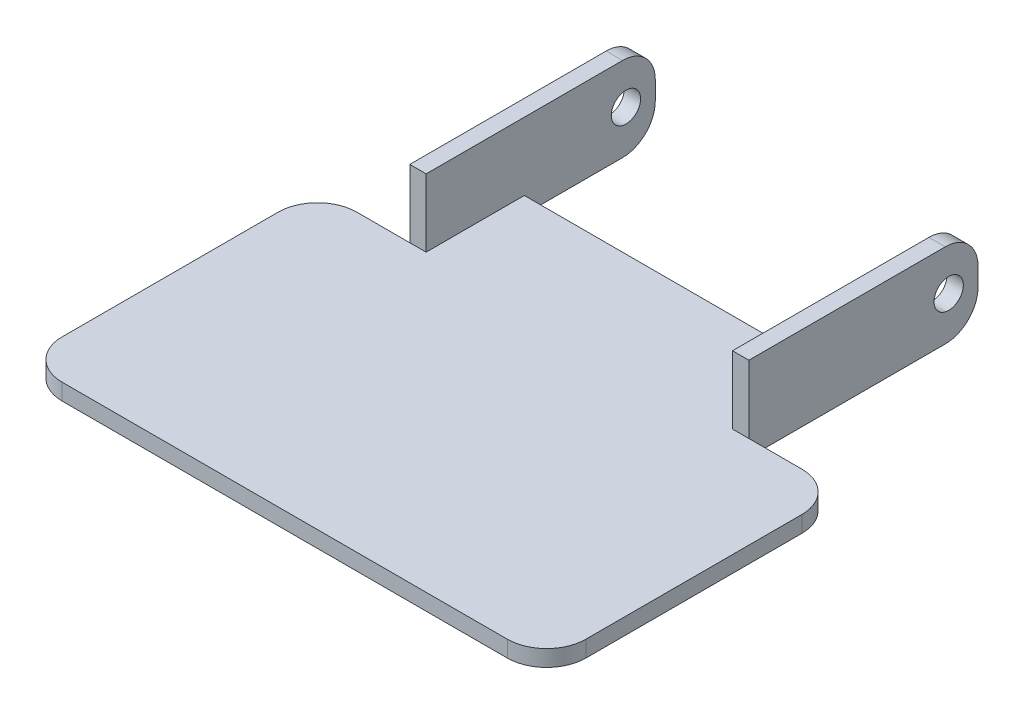
ISO-10303-21;
HEADER;
FILE_DESCRIPTION(('STEP AP214'),'2;1');
FILE_NAME('part.step','',(''),(''),'','','');
FILE_SCHEMA(('AUTOMOTIVE_DESIGN { 1 0 10303 214 1 1 1 1 }'));
ENDSEC;
DATA;
#1=APPLICATION_CONTEXT('core data for automotive mechanical design processes');
#2=APPLICATION_PROTOCOL_DEFINITION('international standard','automotive_design',2000,#1);
#3=PRODUCT_CONTEXT('',#1,'mechanical');
#4=PRODUCT('Part','Part','',(#3));
#5=PRODUCT_RELATED_PRODUCT_CATEGORY('part','',(#4));
#6=PRODUCT_DEFINITION_FORMATION('','',#4);
#7=PRODUCT_DEFINITION_CONTEXT('part definition',#1,'design');
#8=PRODUCT_DEFINITION('design','',#6,#7);
#9=PRODUCT_DEFINITION_SHAPE('','',#8);
#10=(LENGTH_UNIT() NAMED_UNIT(*) SI_UNIT(.MILLI.,.METRE.));
#11=(NAMED_UNIT(*) PLANE_ANGLE_UNIT() SI_UNIT($,.RADIAN.));
#12=(NAMED_UNIT(*) SI_UNIT($,.STERADIAN.) SOLID_ANGLE_UNIT());
#13=UNCERTAINTY_MEASURE_WITH_UNIT(LENGTH_MEASURE(1.E-05),#10,'distance_accuracy_value','');
#14=(GEOMETRIC_REPRESENTATION_CONTEXT(3) GLOBAL_UNCERTAINTY_ASSIGNED_CONTEXT((#13)) GLOBAL_UNIT_ASSIGNED_CONTEXT((#10,
#11,#12)) REPRESENTATION_CONTEXT('',''));
#15=CARTESIAN_POINT('',(0.,0.,0.));
#16=DIRECTION('',(0.,0.,1.));
#17=DIRECTION('',(1.,0.,0.));
#18=AXIS2_PLACEMENT_3D('',#15,#16,#17);
#19=CARTESIAN_POINT('',(0.,1.5875,-28.575));
#20=DIRECTION('',(0.,-1.,0.));
#21=DIRECTION('',(0.,0.,-1.));
#22=AXIS2_PLACEMENT_3D('',#19,#20,#21);
#23=PLANE('',#22);
#24=DIRECTION('',(-1.,0.,0.));
#25=VECTOR('',#24,1.);
#26=CARTESIAN_POINT('',(0.,1.5875,-28.575));
#27=LINE('',#26,#25);
#28=CARTESIAN_POINT('',(8.9535,1.5875,-28.575));
#29=VERTEX_POINT('',#28);
#30=CARTESIAN_POINT('',(3.81,1.5875,-28.575));
#31=VERTEX_POINT('',#30);
#32=EDGE_CURVE('E254',#29,#31,#27,.T.);
#33=ORIENTED_EDGE('',*,*,#32,.T.);
#34=CARTESIAN_POINT('',(3.81,1.5875,-24.765));
#35=DIRECTION('',(0.,-1.,0.));
#36=DIRECTION('',(0.,0.,-1.));
#37=AXIS2_PLACEMENT_3D('',#34,#35,#36);
#38=CIRCLE('',#37,3.81);
#39=CARTESIAN_POINT('',(0.,1.5875,-24.765));
#40=VERTEX_POINT('',#39);
#41=EDGE_CURVE('E319',#31,#40,#38,.F.);
#42=ORIENTED_EDGE('',*,*,#41,.T.);
#43=DIRECTION('',(0.,0.,1.));
#44=VECTOR('',#43,1.);
#45=CARTESIAN_POINT('',(0.,1.5875,0.));
#46=LINE('',#45,#44);
#47=CARTESIAN_POINT('',(0.,1.5875,-3.81));
#48=VERTEX_POINT('',#47);
#49=EDGE_CURVE('E245',#40,#48,#46,.T.);
#50=ORIENTED_EDGE('',*,*,#49,.T.);
#51=CARTESIAN_POINT('',(3.81,1.5875,-3.81));
#52=DIRECTION('',(0.,-1.,0.));
#53=DIRECTION('',(0.,0.,-1.));
#54=AXIS2_PLACEMENT_3D('',#51,#52,#53);
#55=CIRCLE('',#54,3.81);
#56=CARTESIAN_POINT('',(3.81,1.5875,0.));
#57=VERTEX_POINT('',#56);
#58=EDGE_CURVE('E317',#48,#57,#55,.F.);
#59=ORIENTED_EDGE('',*,*,#58,.T.);
#60=DIRECTION('',(1.,0.,0.));
#61=VECTOR('',#60,1.);
#62=CARTESIAN_POINT('',(0.,1.5875,0.));
#63=LINE('',#62,#61);
#64=CARTESIAN_POINT('',(46.99,1.5875,0.));
#65=VERTEX_POINT('',#64);
#66=EDGE_CURVE('E489',#57,#65,#63,.T.);
#67=ORIENTED_EDGE('',*,*,#66,.T.);
#68=CARTESIAN_POINT('',(46.99,1.5875,-3.81));
#69=DIRECTION('',(0.,-1.,0.));
#70=DIRECTION('',(0.,0.,-1.));
#71=AXIS2_PLACEMENT_3D('',#68,#69,#70);
#72=CIRCLE('',#71,3.81);
#73=CARTESIAN_POINT('',(50.8,1.5875,-3.81));
#74=VERTEX_POINT('',#73);
#75=EDGE_CURVE('E315',#65,#74,#72,.F.);
#76=ORIENTED_EDGE('',*,*,#75,.T.);
#77=DIRECTION('',(0.,0.,-1.));
#78=VECTOR('',#77,1.);
#79=CARTESIAN_POINT('',(50.8,1.5875,0.));
#80=LINE('',#79,#78);
#81=CARTESIAN_POINT('',(50.8,1.5875,-24.765));
#82=VERTEX_POINT('',#81);
#83=EDGE_CURVE('E331',#74,#82,#80,.T.);
#84=ORIENTED_EDGE('',*,*,#83,.T.);
#85=CARTESIAN_POINT('',(46.99,1.5875,-24.765));
#86=DIRECTION('',(0.,-1.,0.));
#87=DIRECTION('',(0.,0.,-1.));
#88=AXIS2_PLACEMENT_3D('',#85,#86,#87);
#89=CIRCLE('',#88,3.81);
#90=CARTESIAN_POINT('',(46.99,1.5875,-28.575));
#91=VERTEX_POINT('',#90);
#92=EDGE_CURVE('E48',#82,#91,#89,.F.);
#93=ORIENTED_EDGE('',*,*,#92,.T.);
#94=DIRECTION('',(-1.,0.,0.));
#95=VECTOR('',#94,1.);
#96=CARTESIAN_POINT('',(41.8465,1.5875,-28.575));
#97=LINE('',#96,#95);
#98=CARTESIAN_POINT('',(41.8465,1.5875,-28.575));
#99=VERTEX_POINT('',#98);
#100=EDGE_CURVE('E255',#91,#99,#97,.T.);
#101=ORIENTED_EDGE('',*,*,#100,.T.);
#102=DIRECTION('',(1.,0.,0.));
#103=VECTOR('',#102,1.);
#104=CARTESIAN_POINT('',(41.8465,1.5875,-28.575));
#105=LINE('',#104,#103);
#106=CARTESIAN_POINT('',(40.259,1.5875,-28.575));
#107=VERTEX_POINT('',#106);
#108=EDGE_CURVE('E222',#107,#99,#105,.T.);
#109=ORIENTED_EDGE('',*,*,#108,.F.);
#110=DIRECTION('',(0.,0.,1.));
#111=VECTOR('',#110,1.);
#112=CARTESIAN_POINT('',(40.259,1.5875,-28.575));
#113=LINE('',#112,#111);
#114=CARTESIAN_POINT('',(40.259,1.5875,-38.1));
#115=VERTEX_POINT('',#114);
#116=EDGE_CURVE('E208',#115,#107,#113,.T.);
#117=ORIENTED_EDGE('',*,*,#116,.F.);
#118=DIRECTION('',(-1.,0.,0.));
#119=VECTOR('',#118,1.);
#120=CARTESIAN_POINT('',(10.541,1.5875,-38.1));
#121=LINE('',#120,#119);
#122=CARTESIAN_POINT('',(10.541,1.5875,-38.1));
#123=VERTEX_POINT('',#122);
#124=EDGE_CURVE('E252',#115,#123,#121,.T.);
#125=ORIENTED_EDGE('',*,*,#124,.T.);
#126=DIRECTION('',(0.,0.,-1.));
#127=VECTOR('',#126,1.);
#128=CARTESIAN_POINT('',(10.541,1.5875,-28.575));
#129=LINE('',#128,#127);
#130=CARTESIAN_POINT('',(10.541,1.5875,-28.575));
#131=VERTEX_POINT('',#130);
#132=EDGE_CURVE('E228',#131,#123,#129,.T.);
#133=ORIENTED_EDGE('',*,*,#132,.F.);
#134=DIRECTION('',(1.,0.,0.));
#135=VECTOR('',#134,1.);
#136=CARTESIAN_POINT('',(8.9535,1.5875,-28.575));
#137=LINE('',#136,#135);
#138=EDGE_CURVE('E211',#29,#131,#137,.T.);
#139=ORIENTED_EDGE('',*,*,#138,.F.);
#140=EDGE_LOOP('',(#33,#42,#50,#59,#67,#76,#84,#93,#101,#109,#117,#125,#133,#139));
#141=FACE_BOUND('',#140,.T.);
#142=ADVANCED_FACE('F33',(#141),#23,.F.);
#143=CARTESIAN_POINT('',(0.,1.5875,0.));
#144=DIRECTION('',(1.,0.,0.));
#145=DIRECTION('',(0.,0.,-1.));
#146=AXIS2_PLACEMENT_3D('',#143,#144,#145);
#147=PLANE('',#146);
#148=ORIENTED_EDGE('',*,*,#49,.F.);
#149=DIRECTION('',(0.,-1.,0.));
#150=VECTOR('',#149,1.);
#151=CARTESIAN_POINT('',(0.,1.5875,-24.765));
#152=LINE('',#151,#150);
#153=CARTESIAN_POINT('',(0.,0.,-24.765));
#154=VERTEX_POINT('',#153);
#155=EDGE_CURVE('E301',#40,#154,#152,.T.);
#156=ORIENTED_EDGE('',*,*,#155,.T.);
#157=DIRECTION('',(0.,0.,1.));
#158=VECTOR('',#157,1.);
#159=CARTESIAN_POINT('',(0.,0.,0.));
#160=LINE('',#159,#158);
#161=CARTESIAN_POINT('',(0.,0.,-3.81));
#162=VERTEX_POINT('',#161);
#163=EDGE_CURVE('E241',#154,#162,#160,.T.);
#164=ORIENTED_EDGE('',*,*,#163,.T.);
#165=DIRECTION('',(0.,-1.,0.));
#166=VECTOR('',#165,1.);
#167=CARTESIAN_POINT('',(0.,1.5875,-3.81));
#168=LINE('',#167,#166);
#169=EDGE_CURVE('E299',#162,#48,#168,.F.);
#170=ORIENTED_EDGE('',*,*,#169,.T.);
#171=EDGE_LOOP('',(#148,#156,#164,#170));
#172=FACE_BOUND('',#171,.T.);
#173=ADVANCED_FACE('F410',(#172),#147,.F.);
#174=CARTESIAN_POINT('',(0.,1.5875,0.));
#175=DIRECTION('',(0.,0.,-1.));
#176=DIRECTION('',(-1.,0.,0.));
#177=AXIS2_PLACEMENT_3D('',#174,#175,#176);
#178=PLANE('',#177);
#179=ORIENTED_EDGE('',*,*,#66,.F.);
#180=DIRECTION('',(0.,-1.,0.));
#181=VECTOR('',#180,1.);
#182=CARTESIAN_POINT('',(3.81,1.5875,0.));
#183=LINE('',#182,#181);
#184=CARTESIAN_POINT('',(3.81,0.,0.));
#185=VERTEX_POINT('',#184);
#186=EDGE_CURVE('E323',#57,#185,#183,.T.);
#187=ORIENTED_EDGE('',*,*,#186,.T.);
#188=DIRECTION('',(1.,0.,0.));
#189=VECTOR('',#188,1.);
#190=CARTESIAN_POINT('',(0.,0.,0.));
#191=LINE('',#190,#189);
#192=CARTESIAN_POINT('',(46.99,0.,0.));
#193=VERTEX_POINT('',#192);
#194=EDGE_CURVE('E341',#185,#193,#191,.T.);
#195=ORIENTED_EDGE('',*,*,#194,.T.);
#196=DIRECTION('',(0.,-1.,0.));
#197=VECTOR('',#196,1.);
#198=CARTESIAN_POINT('',(46.99,1.5875,0.));
#199=LINE('',#198,#197);
#200=EDGE_CURVE('E321',#193,#65,#199,.F.);
#201=ORIENTED_EDGE('',*,*,#200,.T.);
#202=EDGE_LOOP('',(#179,#187,#195,#201));
#203=FACE_BOUND('',#202,.T.);
#204=ADVANCED_FACE('F415',(#203),#178,.F.);
#205=CARTESIAN_POINT('',(50.8,1.5875,0.));
#206=DIRECTION('',(-1.,0.,0.));
#207=DIRECTION('',(0.,0.,1.));
#208=AXIS2_PLACEMENT_3D('',#205,#206,#207);
#209=PLANE('',#208);
#210=ORIENTED_EDGE('',*,*,#83,.F.);
#211=DIRECTION('',(0.,-1.,0.));
#212=VECTOR('',#211,1.);
#213=CARTESIAN_POINT('',(50.8,1.5875,-3.81));
#214=LINE('',#213,#212);
#215=CARTESIAN_POINT('',(50.8,0.,-3.81));
#216=VERTEX_POINT('',#215);
#217=EDGE_CURVE('E41',#74,#216,#214,.T.);
#218=ORIENTED_EDGE('',*,*,#217,.T.);
#219=DIRECTION('',(0.,0.,-1.));
#220=VECTOR('',#219,1.);
#221=CARTESIAN_POINT('',(50.8,0.,0.));
#222=LINE('',#221,#220);
#223=CARTESIAN_POINT('',(50.8,0.,-24.765));
#224=VERTEX_POINT('',#223);
#225=EDGE_CURVE('E330',#216,#224,#222,.T.);
#226=ORIENTED_EDGE('',*,*,#225,.T.);
#227=DIRECTION('',(0.,-1.,0.));
#228=VECTOR('',#227,1.);
#229=CARTESIAN_POINT('',(50.8,1.5875,-24.765));
#230=LINE('',#229,#228);
#231=EDGE_CURVE('E56',#224,#82,#230,.F.);
#232=ORIENTED_EDGE('',*,*,#231,.T.);
#233=EDGE_LOOP('',(#210,#218,#226,#232));
#234=FACE_BOUND('',#233,.T.);
#235=ADVANCED_FACE('F329',(#234),#209,.F.);
#236=CARTESIAN_POINT('',(41.8465,1.5875,-28.575));
#237=DIRECTION('',(0.,0.,1.));
#238=DIRECTION('',(1.,0.,0.));
#239=AXIS2_PLACEMENT_3D('',#236,#237,#238);
#240=PLANE('',#239);
#241=ORIENTED_EDGE('',*,*,#100,.F.);
#242=DIRECTION('',(0.,-1.,0.));
#243=VECTOR('',#242,1.);
#244=CARTESIAN_POINT('',(46.99,1.5875,-28.575));
#245=LINE('',#244,#243);
#246=CARTESIAN_POINT('',(46.99,0.,-28.575));
#247=VERTEX_POINT('',#246);
#248=EDGE_CURVE('E11',#91,#247,#245,.T.);
#249=ORIENTED_EDGE('',*,*,#248,.T.);
#250=DIRECTION('',(-1.,0.,0.));
#251=VECTOR('',#250,1.);
#252=CARTESIAN_POINT('',(41.8465,0.,-28.575));
#253=LINE('',#252,#251);
#254=CARTESIAN_POINT('',(41.8465,0.,-28.575));
#255=VERTEX_POINT('',#254);
#256=EDGE_CURVE('E340',#247,#255,#253,.T.);
#257=ORIENTED_EDGE('',*,*,#256,.T.);
#258=DIRECTION('',(0.,-1.,0.));
#259=VECTOR('',#258,1.);
#260=CARTESIAN_POINT('',(41.8465,1.5875,-28.575));
#261=LINE('',#260,#259);
#262=EDGE_CURVE('E250',#99,#255,#261,.T.);
#263=ORIENTED_EDGE('',*,*,#262,.F.);
#264=EDGE_LOOP('',(#241,#249,#257,#263));
#265=FACE_BOUND('',#264,.T.);
#266=ADVANCED_FACE('F406',(#265),#240,.F.);
#267=CARTESIAN_POINT('',(41.8465,1.5875,-50.8));
#268=DIRECTION('',(-1.,0.,0.));
#269=DIRECTION('',(0.,0.,1.));
#270=AXIS2_PLACEMENT_3D('',#267,#268,#269);
#271=PLANE('',#270);
#272=CARTESIAN_POINT('',(41.8465,4.08305,-47.9552));
#273=DIRECTION('',(-1.,0.,0.));
#274=DIRECTION('',(0.,0.,1.));
#275=AXIS2_PLACEMENT_3D('',#272,#273,#274);
#276=CIRCLE('',#275,1.42240000000001);
#277=CARTESIAN_POINT('',(41.8465,4.08305,-46.5328));
#278=VERTEX_POINT('',#277);
#279=EDGE_CURVE('E223',#278,#278,#276,.T.);
#280=ORIENTED_EDGE('',*,*,#279,.T.);
#281=EDGE_LOOP('',(#280));
#282=FACE_BOUND('',#281,.T.);
#283=DIRECTION('',(0.,-1.,0.));
#284=VECTOR('',#283,1.);
#285=CARTESIAN_POINT('',(41.8465,1.5875,-50.8));
#286=LINE('',#285,#284);
#287=CARTESIAN_POINT('',(41.8465,4.9911,-50.8));
#288=VERTEX_POINT('',#287);
#289=CARTESIAN_POINT('',(41.8465,3.175,-50.8));
#290=VERTEX_POINT('',#289);
#291=EDGE_CURVE('E374',#288,#290,#286,.T.);
#292=ORIENTED_EDGE('',*,*,#291,.F.);
#293=CARTESIAN_POINT('',(41.8465,4.9911,-47.625));
#294=DIRECTION('',(-1.,0.,0.));
#295=DIRECTION('',(0.,0.,1.));
#296=AXIS2_PLACEMENT_3D('',#293,#294,#295);
#297=CIRCLE('',#296,3.175);
#298=CARTESIAN_POINT('',(41.8465,8.1661,-47.625));
#299=VERTEX_POINT('',#298);
#300=EDGE_CURVE('E277',#288,#299,#297,.F.);
#301=ORIENTED_EDGE('',*,*,#300,.T.);
#302=DIRECTION('',(0.,0.,-1.));
#303=VECTOR('',#302,1.);
#304=CARTESIAN_POINT('',(41.8465,8.1661,-28.575));
#305=LINE('',#304,#303);
#306=CARTESIAN_POINT('',(41.8465,8.1661,-28.575));
#307=VERTEX_POINT('',#306);
#308=EDGE_CURVE('E200',#307,#299,#305,.T.);
#309=ORIENTED_EDGE('',*,*,#308,.F.);
#310=DIRECTION('',(0.,-1.,0.));
#311=VECTOR('',#310,1.);
#312=CARTESIAN_POINT('',(41.8465,8.1661,-28.575));
#313=LINE('',#312,#311);
#314=EDGE_CURVE('E212',#307,#99,#313,.T.);
#315=ORIENTED_EDGE('',*,*,#314,.T.);
#316=ORIENTED_EDGE('',*,*,#262,.T.);
#317=DIRECTION('',(0.,0.,-1.));
#318=VECTOR('',#317,1.);
#319=CARTESIAN_POINT('',(41.8465,0.,-50.8));
#320=LINE('',#319,#318);
#321=CARTESIAN_POINT('',(41.8465,0.,-47.625));
#322=VERTEX_POINT('',#321);
#323=EDGE_CURVE('E343',#255,#322,#320,.T.);
#324=ORIENTED_EDGE('',*,*,#323,.T.);
#325=CARTESIAN_POINT('',(41.8465,3.175,-47.625));
#326=DIRECTION('',(-1.,0.,0.));
#327=DIRECTION('',(0.,0.,1.));
#328=AXIS2_PLACEMENT_3D('',#325,#326,#327);
#329=CIRCLE('',#328,3.175);
#330=EDGE_CURVE('E275',#322,#290,#329,.F.);
#331=ORIENTED_EDGE('',*,*,#330,.T.);
#332=EDGE_LOOP('',(#292,#301,#309,#315,#316,#324,#331));
#333=FACE_BOUND('',#332,.T.);
#334=ADVANCED_FACE('F383',(#282,#333),#271,.F.);
#335=CARTESIAN_POINT('',(40.259,1.5875,-50.8));
#336=DIRECTION('',(0.,0.,1.));
#337=DIRECTION('',(1.,0.,0.));
#338=AXIS2_PLACEMENT_3D('',#335,#336,#337);
#339=PLANE('',#338);
#340=DIRECTION('',(0.,-1.,0.));
#341=VECTOR('',#340,1.);
#342=CARTESIAN_POINT('',(40.259,1.5875,-50.8));
#343=LINE('',#342,#341);
#344=CARTESIAN_POINT('',(40.259,4.9911,-50.8));
#345=VERTEX_POINT('',#344);
#346=CARTESIAN_POINT('',(40.259,3.175,-50.8));
#347=VERTEX_POINT('',#346);
#348=EDGE_CURVE('E372',#345,#347,#343,.T.);
#349=ORIENTED_EDGE('',*,*,#348,.F.);
#350=DIRECTION('',(-1.,0.,0.));
#351=VECTOR('',#350,1.);
#352=CARTESIAN_POINT('',(41.8465,4.9911,-50.8));
#353=LINE('',#352,#351);
#354=EDGE_CURVE('E273',#345,#288,#353,.F.);
#355=ORIENTED_EDGE('',*,*,#354,.T.);
#356=ORIENTED_EDGE('',*,*,#291,.T.);
#357=DIRECTION('',(-1.,0.,0.));
#358=VECTOR('',#357,1.);
#359=CARTESIAN_POINT('',(40.259,3.175,-50.8));
#360=LINE('',#359,#358);
#361=EDGE_CURVE('E270',#290,#347,#360,.T.);
#362=ORIENTED_EDGE('',*,*,#361,.T.);
#363=EDGE_LOOP('',(#349,#355,#356,#362));
#364=FACE_BOUND('',#363,.T.);
#365=ADVANCED_FACE('F396',(#364),#339,.F.);
#366=CARTESIAN_POINT('',(40.259,1.5875,-38.1));
#367=DIRECTION('',(1.,0.,0.));
#368=DIRECTION('',(0.,0.,-1.));
#369=AXIS2_PLACEMENT_3D('',#366,#367,#368);
#370=PLANE('',#369);
#371=CARTESIAN_POINT('',(40.259,4.08305,-47.9552));
#372=DIRECTION('',(1.,0.,0.));
#373=DIRECTION('',(0.,0.,-1.));
#374=AXIS2_PLACEMENT_3D('',#371,#372,#373);
#375=CIRCLE('',#374,1.42240000000001);
#376=CARTESIAN_POINT('',(40.259,4.08305,-49.3776));
#377=VERTEX_POINT('',#376);
#378=EDGE_CURVE('E713',#377,#377,#375,.T.);
#379=ORIENTED_EDGE('',*,*,#378,.T.);
#380=EDGE_LOOP('',(#379));
#381=FACE_BOUND('',#380,.T.);
#382=DIRECTION('',(0.,0.,1.));
#383=VECTOR('',#382,1.);
#384=CARTESIAN_POINT('',(40.259,8.1661,-28.575));
#385=LINE('',#384,#383);
#386=CARTESIAN_POINT('',(40.259,8.1661,-47.625));
#387=VERTEX_POINT('',#386);
#388=CARTESIAN_POINT('',(40.259,8.1661,-28.575));
#389=VERTEX_POINT('',#388);
#390=EDGE_CURVE('E190',#387,#389,#385,.T.);
#391=ORIENTED_EDGE('',*,*,#390,.F.);
#392=CARTESIAN_POINT('',(40.259,4.9911,-47.625));
#393=DIRECTION('',(1.,0.,0.));
#394=DIRECTION('',(0.,0.,-1.));
#395=AXIS2_PLACEMENT_3D('',#392,#393,#394);
#396=CIRCLE('',#395,3.175);
#397=EDGE_CURVE('E268',#387,#345,#396,.F.);
#398=ORIENTED_EDGE('',*,*,#397,.T.);
#399=ORIENTED_EDGE('',*,*,#348,.T.);
#400=CARTESIAN_POINT('',(40.259,3.175,-47.625));
#401=DIRECTION('',(1.,0.,0.));
#402=DIRECTION('',(0.,0.,-1.));
#403=AXIS2_PLACEMENT_3D('',#400,#401,#402);
#404=CIRCLE('',#403,3.175);
#405=CARTESIAN_POINT('',(40.259,0.,-47.625));
#406=VERTEX_POINT('',#405);
#407=EDGE_CURVE('E266',#347,#406,#404,.F.);
#408=ORIENTED_EDGE('',*,*,#407,.T.);
#409=DIRECTION('',(0.,0.,1.));
#410=VECTOR('',#409,1.);
#411=CARTESIAN_POINT('',(40.259,0.,-38.1));
#412=LINE('',#411,#410);
#413=CARTESIAN_POINT('',(40.259,0.,-38.1));
#414=VERTEX_POINT('',#413);
#415=EDGE_CURVE('E350',#406,#414,#412,.T.);
#416=ORIENTED_EDGE('',*,*,#415,.T.);
#417=DIRECTION('',(0.,-1.,0.));
#418=VECTOR('',#417,1.);
#419=CARTESIAN_POINT('',(40.259,1.5875,-38.1));
#420=LINE('',#419,#418);
#421=EDGE_CURVE('E261',#115,#414,#420,.T.);
#422=ORIENTED_EDGE('',*,*,#421,.F.);
#423=ORIENTED_EDGE('',*,*,#116,.T.);
#424=DIRECTION('',(0.,-1.,0.));
#425=VECTOR('',#424,1.);
#426=CARTESIAN_POINT('',(40.259,8.1661,-28.575));
#427=LINE('',#426,#425);
#428=EDGE_CURVE('E204',#389,#107,#427,.T.);
#429=ORIENTED_EDGE('',*,*,#428,.F.);
#430=EDGE_LOOP('',(#391,#398,#399,#408,#416,#422,#423,#429));
#431=FACE_BOUND('',#430,.T.);
#432=ADVANCED_FACE('F205',(#381,#431),#370,.F.);
#433=CARTESIAN_POINT('',(10.541,1.5875,-38.1));
#434=DIRECTION('',(0.,0.,1.));
#435=DIRECTION('',(1.,0.,0.));
#436=AXIS2_PLACEMENT_3D('',#433,#434,#435);
#437=PLANE('',#436);
#438=DIRECTION('',(-1.,0.,0.));
#439=VECTOR('',#438,1.);
#440=CARTESIAN_POINT('',(10.541,0.,-38.1));
#441=LINE('',#440,#439);
#442=CARTESIAN_POINT('',(10.541,0.,-38.1));
#443=VERTEX_POINT('',#442);
#444=EDGE_CURVE('E352',#414,#443,#441,.T.);
#445=ORIENTED_EDGE('',*,*,#444,.T.);
#446=DIRECTION('',(0.,-1.,0.));
#447=VECTOR('',#446,1.);
#448=CARTESIAN_POINT('',(10.541,1.5875,-38.1));
#449=LINE('',#448,#447);
#450=EDGE_CURVE('E258',#123,#443,#449,.T.);
#451=ORIENTED_EDGE('',*,*,#450,.F.);
#452=ORIENTED_EDGE('',*,*,#124,.F.);
#453=ORIENTED_EDGE('',*,*,#421,.T.);
#454=EDGE_LOOP('',(#445,#451,#452,#453));
#455=FACE_BOUND('',#454,.T.);
#456=ADVANCED_FACE('F403',(#455),#437,.F.);
#457=CARTESIAN_POINT('',(10.541,1.5875,-50.8));
#458=DIRECTION('',(-1.,0.,0.));
#459=DIRECTION('',(0.,0.,1.));
#460=AXIS2_PLACEMENT_3D('',#457,#458,#459);
#461=PLANE('',#460);
#462=CARTESIAN_POINT('',(10.541,4.08305,-47.9552));
#463=DIRECTION('',(-1.,0.,0.));
#464=DIRECTION('',(0.,0.,1.));
#465=AXIS2_PLACEMENT_3D('',#462,#463,#464);
#466=CIRCLE('',#465,1.42240000000001);
#467=CARTESIAN_POINT('',(10.541,4.08305,-46.5328));
#468=VERTEX_POINT('',#467);
#469=EDGE_CURVE('E717',#468,#468,#466,.T.);
#470=ORIENTED_EDGE('',*,*,#469,.T.);
#471=EDGE_LOOP('',(#470));
#472=FACE_BOUND('',#471,.T.);
#473=DIRECTION('',(0.,-1.,0.));
#474=VECTOR('',#473,1.);
#475=CARTESIAN_POINT('',(10.541,1.5875,-50.8));
#476=LINE('',#475,#474);
#477=CARTESIAN_POINT('',(10.541,4.9911,-50.8));
#478=VERTEX_POINT('',#477);
#479=CARTESIAN_POINT('',(10.541,3.175,-50.8));
#480=VERTEX_POINT('',#479);
#481=EDGE_CURVE('E262',#478,#480,#476,.T.);
#482=ORIENTED_EDGE('',*,*,#481,.F.);
#483=CARTESIAN_POINT('',(10.541,4.9911,-47.625));
#484=DIRECTION('',(-1.,0.,0.));
#485=DIRECTION('',(0.,0.,1.));
#486=AXIS2_PLACEMENT_3D('',#483,#484,#485);
#487=CIRCLE('',#486,3.175);
#488=CARTESIAN_POINT('',(10.541,8.1661,-47.625));
#489=VERTEX_POINT('',#488);
#490=EDGE_CURVE('E297',#478,#489,#487,.F.);
#491=ORIENTED_EDGE('',*,*,#490,.T.);
#492=DIRECTION('',(0.,0.,-1.));
#493=VECTOR('',#492,1.);
#494=CARTESIAN_POINT('',(10.541,8.1661,-28.575));
#495=LINE('',#494,#493);
#496=CARTESIAN_POINT('',(10.541,8.1661,-28.575));
#497=VERTEX_POINT('',#496);
#498=EDGE_CURVE('E230',#497,#489,#495,.T.);
#499=ORIENTED_EDGE('',*,*,#498,.F.);
#500=DIRECTION('',(0.,-1.,0.));
#501=VECTOR('',#500,1.);
#502=CARTESIAN_POINT('',(10.541,8.1661,-28.575));
#503=LINE('',#502,#501);
#504=EDGE_CURVE('E233',#497,#131,#503,.T.);
#505=ORIENTED_EDGE('',*,*,#504,.T.);
#506=ORIENTED_EDGE('',*,*,#132,.T.);
#507=ORIENTED_EDGE('',*,*,#450,.T.);
#508=DIRECTION('',(0.,0.,-1.));
#509=VECTOR('',#508,1.);
#510=CARTESIAN_POINT('',(10.541,0.,-50.8));
#511=LINE('',#510,#509);
#512=CARTESIAN_POINT('',(10.541,0.,-47.625));
#513=VERTEX_POINT('',#512);
#514=EDGE_CURVE('E354',#443,#513,#511,.T.);
#515=ORIENTED_EDGE('',*,*,#514,.T.);
#516=CARTESIAN_POINT('',(10.541,3.175,-47.625));
#517=DIRECTION('',(-1.,0.,0.));
#518=DIRECTION('',(0.,0.,1.));
#519=AXIS2_PLACEMENT_3D('',#516,#517,#518);
#520=CIRCLE('',#519,3.175);
#521=EDGE_CURVE('E295',#513,#480,#520,.F.);
#522=ORIENTED_EDGE('',*,*,#521,.T.);
#523=EDGE_LOOP('',(#482,#491,#499,#505,#506,#507,#515,#522));
#524=FACE_BOUND('',#523,.T.);
#525=ADVANCED_FACE('F436',(#472,#524),#461,.F.);
#526=CARTESIAN_POINT('',(8.9535,1.5875,-50.8));
#527=DIRECTION('',(0.,0.,1.));
#528=DIRECTION('',(1.,0.,0.));
#529=AXIS2_PLACEMENT_3D('',#526,#527,#528);
#530=PLANE('',#529);
#531=DIRECTION('',(0.,-1.,0.));
#532=VECTOR('',#531,1.);
#533=CARTESIAN_POINT('',(8.9535,1.5875,-50.8));
#534=LINE('',#533,#532);
#535=CARTESIAN_POINT('',(8.9535,4.9911,-50.8));
#536=VERTEX_POINT('',#535);
#537=CARTESIAN_POINT('',(8.9535,3.175,-50.8));
#538=VERTEX_POINT('',#537);
#539=EDGE_CURVE('E365',#536,#538,#534,.T.);
#540=ORIENTED_EDGE('',*,*,#539,.F.);
#541=DIRECTION('',(-1.,0.,0.));
#542=VECTOR('',#541,1.);
#543=CARTESIAN_POINT('',(8.9535,4.9911,-50.8));
#544=LINE('',#543,#542);
#545=EDGE_CURVE('E293',#536,#478,#544,.F.);
#546=ORIENTED_EDGE('',*,*,#545,.T.);
#547=ORIENTED_EDGE('',*,*,#481,.T.);
#548=DIRECTION('',(-1.,0.,0.));
#549=VECTOR('',#548,1.);
#550=CARTESIAN_POINT('',(8.9535,3.175,-50.8));
#551=LINE('',#550,#549);
#552=EDGE_CURVE('E290',#480,#538,#551,.T.);
#553=ORIENTED_EDGE('',*,*,#552,.T.);
#554=EDGE_LOOP('',(#540,#546,#547,#553));
#555=FACE_BOUND('',#554,.T.);
#556=ADVANCED_FACE('F432',(#555),#530,.F.);
#557=CARTESIAN_POINT('',(8.9535,1.5875,-28.575));
#558=DIRECTION('',(1.,0.,0.));
#559=DIRECTION('',(0.,0.,-1.));
#560=AXIS2_PLACEMENT_3D('',#557,#558,#559);
#561=PLANE('',#560);
#562=CARTESIAN_POINT('',(8.9535,4.08305,-47.9552));
#563=DIRECTION('',(-1.,0.,0.));
#564=DIRECTION('',(0.,0.,1.));
#565=AXIS2_PLACEMENT_3D('',#562,#563,#564);
#566=CIRCLE('',#565,1.42240000000001);
#567=CARTESIAN_POINT('',(8.9535,4.08305,-46.5328));
#568=VERTEX_POINT('',#567);
#569=EDGE_CURVE('E722',#568,#568,#566,.T.);
#570=ORIENTED_EDGE('',*,*,#569,.F.);
#571=EDGE_LOOP('',(#570));
#572=FACE_BOUND('',#571,.T.);
#573=DIRECTION('',(0.,0.,1.));
#574=VECTOR('',#573,1.);
#575=CARTESIAN_POINT('',(8.9535,8.1661,-28.575));
#576=LINE('',#575,#574);
#577=CARTESIAN_POINT('',(8.9535,8.1661,-47.625));
#578=VERTEX_POINT('',#577);
#579=CARTESIAN_POINT('',(8.9535,8.1661,-28.575));
#580=VERTEX_POINT('',#579);
#581=EDGE_CURVE('E225',#578,#580,#576,.T.);
#582=ORIENTED_EDGE('',*,*,#581,.F.);
#583=CARTESIAN_POINT('',(8.9535,4.9911,-47.625));
#584=DIRECTION('',(1.,0.,0.));
#585=DIRECTION('',(0.,0.,-1.));
#586=AXIS2_PLACEMENT_3D('',#583,#584,#585);
#587=CIRCLE('',#586,3.175);
#588=EDGE_CURVE('E288',#578,#536,#587,.F.);
#589=ORIENTED_EDGE('',*,*,#588,.T.);
#590=ORIENTED_EDGE('',*,*,#539,.T.);
#591=CARTESIAN_POINT('',(8.9535,3.175,-47.625));
#592=DIRECTION('',(1.,0.,0.));
#593=DIRECTION('',(0.,0.,-1.));
#594=AXIS2_PLACEMENT_3D('',#591,#592,#593);
#595=CIRCLE('',#594,3.175);
#596=CARTESIAN_POINT('',(8.9535,0.,-47.625));
#597=VERTEX_POINT('',#596);
#598=EDGE_CURVE('E286',#538,#597,#595,.F.);
#599=ORIENTED_EDGE('',*,*,#598,.T.);
#600=DIRECTION('',(0.,0.,1.));
#601=VECTOR('',#600,1.);
#602=CARTESIAN_POINT('',(8.9535,0.,-28.575));
#603=LINE('',#602,#601);
#604=CARTESIAN_POINT('',(8.9535,0.,-28.575));
#605=VERTEX_POINT('',#604);
#606=EDGE_CURVE('E357',#597,#605,#603,.T.);
#607=ORIENTED_EDGE('',*,*,#606,.T.);
#608=DIRECTION('',(0.,-1.,0.));
#609=VECTOR('',#608,1.);
#610=CARTESIAN_POINT('',(8.9535,1.5875,-28.575));
#611=LINE('',#610,#609);
#612=EDGE_CURVE('E362',#29,#605,#611,.T.);
#613=ORIENTED_EDGE('',*,*,#612,.F.);
#614=DIRECTION('',(0.,-1.,0.));
#615=VECTOR('',#614,1.);
#616=CARTESIAN_POINT('',(8.9535,8.1661,-28.575));
#617=LINE('',#616,#615);
#618=EDGE_CURVE('E238',#580,#29,#617,.T.);
#619=ORIENTED_EDGE('',*,*,#618,.F.);
#620=EDGE_LOOP('',(#582,#589,#590,#599,#607,#613,#619));
#621=FACE_BOUND('',#620,.T.);
#622=ADVANCED_FACE('F428',(#572,#621),#561,.F.);
#623=CARTESIAN_POINT('',(0.,1.5875,-28.575));
#624=DIRECTION('',(0.,0.,1.));
#625=DIRECTION('',(1.,0.,0.));
#626=AXIS2_PLACEMENT_3D('',#623,#624,#625);
#627=PLANE('',#626);
#628=DIRECTION('',(-1.,0.,0.));
#629=VECTOR('',#628,1.);
#630=CARTESIAN_POINT('',(0.,0.,-28.575));
#631=LINE('',#630,#629);
#632=CARTESIAN_POINT('',(3.81,0.,-28.575));
#633=VERTEX_POINT('',#632);
#634=EDGE_CURVE('E359',#605,#633,#631,.T.);
#635=ORIENTED_EDGE('',*,*,#634,.T.);
#636=DIRECTION('',(0.,-1.,0.));
#637=VECTOR('',#636,1.);
#638=CARTESIAN_POINT('',(3.81,1.5875,-28.575));
#639=LINE('',#638,#637);
#640=EDGE_CURVE('E312',#633,#31,#639,.F.);
#641=ORIENTED_EDGE('',*,*,#640,.T.);
#642=ORIENTED_EDGE('',*,*,#32,.F.);
#643=ORIENTED_EDGE('',*,*,#612,.T.);
#644=EDGE_LOOP('',(#635,#641,#642,#643));
#645=FACE_BOUND('',#644,.T.);
#646=ADVANCED_FACE('F425',(#645),#627,.F.);
#647=CARTESIAN_POINT('',(0.,0.,-28.575));
#648=DIRECTION('',(0.,-1.,0.));
#649=DIRECTION('',(0.,0.,-1.));
#650=AXIS2_PLACEMENT_3D('',#647,#648,#649);
#651=PLANE('',#650);
#652=ORIENTED_EDGE('',*,*,#163,.F.);
#653=CARTESIAN_POINT('',(3.81,0.,-24.765));
#654=DIRECTION('',(0.,-1.,0.));
#655=DIRECTION('',(0.,0.,-1.));
#656=AXIS2_PLACEMENT_3D('',#653,#654,#655);
#657=CIRCLE('',#656,3.81);
#658=EDGE_CURVE('E310',#154,#633,#657,.T.);
#659=ORIENTED_EDGE('',*,*,#658,.T.);
#660=ORIENTED_EDGE('',*,*,#634,.F.);
#661=ORIENTED_EDGE('',*,*,#606,.F.);
#662=DIRECTION('',(-1.,0.,0.));
#663=VECTOR('',#662,1.);
#664=CARTESIAN_POINT('',(10.541,0.,-47.625));
#665=LINE('',#664,#663);
#666=EDGE_CURVE('E279',#597,#513,#665,.F.);
#667=ORIENTED_EDGE('',*,*,#666,.T.);
#668=ORIENTED_EDGE('',*,*,#514,.F.);
#669=ORIENTED_EDGE('',*,*,#444,.F.);
#670=ORIENTED_EDGE('',*,*,#415,.F.);
#671=DIRECTION('',(-1.,0.,0.));
#672=VECTOR('',#671,1.);
#673=CARTESIAN_POINT('',(41.8465,0.,-47.625));
#674=LINE('',#673,#672);
#675=EDGE_CURVE('E281',#406,#322,#674,.F.);
#676=ORIENTED_EDGE('',*,*,#675,.T.);
#677=ORIENTED_EDGE('',*,*,#323,.F.);
#678=ORIENTED_EDGE('',*,*,#256,.F.);
#679=CARTESIAN_POINT('',(46.99,0.,-24.765));
#680=DIRECTION('',(0.,-1.,0.));
#681=DIRECTION('',(0.,0.,-1.));
#682=AXIS2_PLACEMENT_3D('',#679,#680,#681);
#683=CIRCLE('',#682,3.81);
#684=EDGE_CURVE('E304',#247,#224,#683,.T.);
#685=ORIENTED_EDGE('',*,*,#684,.T.);
#686=ORIENTED_EDGE('',*,*,#225,.F.);
#687=CARTESIAN_POINT('',(46.99,0.,-3.81));
#688=DIRECTION('',(0.,-1.,0.));
#689=DIRECTION('',(0.,0.,-1.));
#690=AXIS2_PLACEMENT_3D('',#687,#688,#689);
#691=CIRCLE('',#690,3.81);
#692=EDGE_CURVE('E306',#216,#193,#691,.T.);
#693=ORIENTED_EDGE('',*,*,#692,.T.);
#694=ORIENTED_EDGE('',*,*,#194,.F.);
#695=CARTESIAN_POINT('',(3.81,0.,-3.81));
#696=DIRECTION('',(0.,-1.,0.));
#697=DIRECTION('',(0.,0.,-1.));
#698=AXIS2_PLACEMENT_3D('',#695,#696,#697);
#699=CIRCLE('',#698,3.81);
#700=EDGE_CURVE('E308',#185,#162,#699,.T.);
#701=ORIENTED_EDGE('',*,*,#700,.T.);
#702=EDGE_LOOP('',(#652,#659,#660,#661,#667,#668,#669,#670,#676,#677,#678,#685,#686,#693,#694,#701));
#703=FACE_BOUND('',#702,.T.);
#704=ADVANCED_FACE('F336',(#703),#651,.T.);
#705=CARTESIAN_POINT('',(8.9535,8.1661,-28.575));
#706=DIRECTION('',(0.,0.,-1.));
#707=DIRECTION('',(-1.,0.,0.));
#708=AXIS2_PLACEMENT_3D('',#705,#706,#707);
#709=PLANE('',#708);
#710=ORIENTED_EDGE('',*,*,#138,.T.);
#711=ORIENTED_EDGE('',*,*,#504,.F.);
#712=DIRECTION('',(1.,0.,0.));
#713=VECTOR('',#712,1.);
#714=CARTESIAN_POINT('',(8.9535,8.1661,-28.575));
#715=LINE('',#714,#713);
#716=EDGE_CURVE('E227',#580,#497,#715,.T.);
#717=ORIENTED_EDGE('',*,*,#716,.F.);
#718=ORIENTED_EDGE('',*,*,#618,.T.);
#719=EDGE_LOOP('',(#710,#711,#717,#718));
#720=FACE_BOUND('',#719,.T.);
#721=ADVANCED_FACE('F421',(#720),#709,.F.);
#722=CARTESIAN_POINT('',(8.9535,8.1661,-50.8));
#723=DIRECTION('',(0.,-1.,0.));
#724=DIRECTION('',(0.,0.,-1.));
#725=AXIS2_PLACEMENT_3D('',#722,#723,#724);
#726=PLANE('',#725);
#727=ORIENTED_EDGE('',*,*,#498,.T.);
#728=DIRECTION('',(-1.,0.,0.));
#729=VECTOR('',#728,1.);
#730=CARTESIAN_POINT('',(8.9535,8.1661,-47.625));
#731=LINE('',#730,#729);
#732=EDGE_CURVE('E283',#489,#578,#731,.T.);
#733=ORIENTED_EDGE('',*,*,#732,.T.);
#734=ORIENTED_EDGE('',*,*,#581,.T.);
#735=ORIENTED_EDGE('',*,*,#716,.T.);
#736=EDGE_LOOP('',(#727,#733,#734,#735));
#737=FACE_BOUND('',#736,.T.);
#738=ADVANCED_FACE('F464',(#737),#726,.F.);
#739=CARTESIAN_POINT('',(41.8465,8.1661,-28.575));
#740=DIRECTION('',(0.,0.,-1.));
#741=DIRECTION('',(-1.,0.,0.));
#742=AXIS2_PLACEMENT_3D('',#739,#740,#741);
#743=PLANE('',#742);
#744=ORIENTED_EDGE('',*,*,#108,.T.);
#745=ORIENTED_EDGE('',*,*,#314,.F.);
#746=DIRECTION('',(1.,0.,0.));
#747=VECTOR('',#746,1.);
#748=CARTESIAN_POINT('',(41.8465,8.1661,-28.575));
#749=LINE('',#748,#747);
#750=EDGE_CURVE('E195',#389,#307,#749,.T.);
#751=ORIENTED_EDGE('',*,*,#750,.F.);
#752=ORIENTED_EDGE('',*,*,#428,.T.);
#753=EDGE_LOOP('',(#744,#745,#751,#752));
#754=FACE_BOUND('',#753,.T.);
#755=ADVANCED_FACE('F214',(#754),#743,.F.);
#756=CARTESIAN_POINT('',(41.8465,8.1661,-50.8));
#757=DIRECTION('',(0.,1.,0.));
#758=DIRECTION('',(0.,0.,1.));
#759=AXIS2_PLACEMENT_3D('',#756,#757,#758);
#760=PLANE('',#759);
#761=ORIENTED_EDGE('',*,*,#308,.T.);
#762=DIRECTION('',(-1.,0.,0.));
#763=VECTOR('',#762,1.);
#764=CARTESIAN_POINT('',(40.259,8.1661,-47.625));
#765=LINE('',#764,#763);
#766=EDGE_CURVE('E198',#299,#387,#765,.T.);
#767=ORIENTED_EDGE('',*,*,#766,.T.);
#768=ORIENTED_EDGE('',*,*,#390,.T.);
#769=ORIENTED_EDGE('',*,*,#750,.T.);
#770=EDGE_LOOP('',(#761,#767,#768,#769));
#771=FACE_BOUND('',#770,.T.);
#772=ADVANCED_FACE('F193',(#771),#760,.T.);
#773=CARTESIAN_POINT('',(41.8465,4.9911,-47.625));
#774=DIRECTION('',(1.,0.,0.));
#775=DIRECTION('',(0.,0.,-1.));
#776=AXIS2_PLACEMENT_3D('',#773,#774,#775);
#777=CYLINDRICAL_SURFACE('',#776,3.175);
#778=ORIENTED_EDGE('',*,*,#300,.F.);
#779=ORIENTED_EDGE('',*,*,#354,.F.);
#780=ORIENTED_EDGE('',*,*,#397,.F.);
#781=ORIENTED_EDGE('',*,*,#766,.F.);
#782=EDGE_LOOP('',(#778,#779,#780,#781));
#783=FACE_BOUND('',#782,.T.);
#784=ADVANCED_FACE('F394',(#783),#777,.T.);
#785=CARTESIAN_POINT('',(40.259,3.175,-47.625));
#786=DIRECTION('',(1.,0.,0.));
#787=DIRECTION('',(0.,0.,-1.));
#788=AXIS2_PLACEMENT_3D('',#785,#786,#787);
#789=CYLINDRICAL_SURFACE('',#788,3.175);
#790=ORIENTED_EDGE('',*,*,#330,.F.);
#791=ORIENTED_EDGE('',*,*,#675,.F.);
#792=ORIENTED_EDGE('',*,*,#407,.F.);
#793=ORIENTED_EDGE('',*,*,#361,.F.);
#794=EDGE_LOOP('',(#790,#791,#792,#793));
#795=FACE_BOUND('',#794,.T.);
#796=ADVANCED_FACE('F390',(#795),#789,.T.);
#797=CARTESIAN_POINT('',(8.9535,4.9911,-47.625));
#798=DIRECTION('',(-1.,0.,0.));
#799=DIRECTION('',(0.,0.,1.));
#800=AXIS2_PLACEMENT_3D('',#797,#798,#799);
#801=CYLINDRICAL_SURFACE('',#800,3.175);
#802=ORIENTED_EDGE('',*,*,#490,.F.);
#803=ORIENTED_EDGE('',*,*,#545,.F.);
#804=ORIENTED_EDGE('',*,*,#588,.F.);
#805=ORIENTED_EDGE('',*,*,#732,.F.);
#806=EDGE_LOOP('',(#802,#803,#804,#805));
#807=FACE_BOUND('',#806,.T.);
#808=ADVANCED_FACE('F460',(#807),#801,.T.);
#809=CARTESIAN_POINT('',(8.9535,3.175,-47.625));
#810=DIRECTION('',(1.,0.,0.));
#811=DIRECTION('',(0.,0.,-1.));
#812=AXIS2_PLACEMENT_3D('',#809,#810,#811);
#813=CYLINDRICAL_SURFACE('',#812,3.175);
#814=ORIENTED_EDGE('',*,*,#521,.F.);
#815=ORIENTED_EDGE('',*,*,#666,.F.);
#816=ORIENTED_EDGE('',*,*,#598,.F.);
#817=ORIENTED_EDGE('',*,*,#552,.F.);
#818=EDGE_LOOP('',(#814,#815,#816,#817));
#819=FACE_BOUND('',#818,.T.);
#820=ADVANCED_FACE('F454',(#819),#813,.T.);
#821=CARTESIAN_POINT('',(3.81,1.5875,-24.765));
#822=DIRECTION('',(0.,-1.,0.));
#823=DIRECTION('',(0.,0.,-1.));
#824=AXIS2_PLACEMENT_3D('',#821,#822,#823);
#825=CYLINDRICAL_SURFACE('',#824,3.81);
#826=ORIENTED_EDGE('',*,*,#41,.F.);
#827=ORIENTED_EDGE('',*,*,#640,.F.);
#828=ORIENTED_EDGE('',*,*,#658,.F.);
#829=ORIENTED_EDGE('',*,*,#155,.F.);
#830=EDGE_LOOP('',(#826,#827,#828,#829));
#831=FACE_BOUND('',#830,.T.);
#832=ADVANCED_FACE('F507',(#831),#825,.T.);
#833=CARTESIAN_POINT('',(3.81,1.5875,-3.81));
#834=DIRECTION('',(0.,-1.,0.));
#835=DIRECTION('',(0.,0.,-1.));
#836=AXIS2_PLACEMENT_3D('',#833,#834,#835);
#837=CYLINDRICAL_SURFACE('',#836,3.81);
#838=ORIENTED_EDGE('',*,*,#58,.F.);
#839=ORIENTED_EDGE('',*,*,#169,.F.);
#840=ORIENTED_EDGE('',*,*,#700,.F.);
#841=ORIENTED_EDGE('',*,*,#186,.F.);
#842=EDGE_LOOP('',(#838,#839,#840,#841));
#843=FACE_BOUND('',#842,.T.);
#844=ADVANCED_FACE('F485',(#843),#837,.T.);
#845=CARTESIAN_POINT('',(46.99,1.5875,-3.81));
#846=DIRECTION('',(0.,-1.,0.));
#847=DIRECTION('',(0.,0.,-1.));
#848=AXIS2_PLACEMENT_3D('',#845,#846,#847);
#849=CYLINDRICAL_SURFACE('',#848,3.81);
#850=ORIENTED_EDGE('',*,*,#75,.F.);
#851=ORIENTED_EDGE('',*,*,#200,.F.);
#852=ORIENTED_EDGE('',*,*,#692,.F.);
#853=ORIENTED_EDGE('',*,*,#217,.F.);
#854=EDGE_LOOP('',(#850,#851,#852,#853));
#855=FACE_BOUND('',#854,.T.);
#856=ADVANCED_FACE('F496',(#855),#849,.T.);
#857=CARTESIAN_POINT('',(46.99,1.5875,-24.765));
#858=DIRECTION('',(0.,-1.,0.));
#859=DIRECTION('',(0.,0.,-1.));
#860=AXIS2_PLACEMENT_3D('',#857,#858,#859);
#861=CYLINDRICAL_SURFACE('',#860,3.81);
#862=ORIENTED_EDGE('',*,*,#92,.F.);
#863=ORIENTED_EDGE('',*,*,#231,.F.);
#864=ORIENTED_EDGE('',*,*,#684,.F.);
#865=ORIENTED_EDGE('',*,*,#248,.F.);
#866=EDGE_LOOP('',(#862,#863,#864,#865));
#867=FACE_BOUND('',#866,.T.);
#868=ADVANCED_FACE('F35',(#867),#861,.T.);
#869=CARTESIAN_POINT('',(8.9535,4.08305,-47.9552));
#870=DIRECTION('',(-1.,0.,0.));
#871=DIRECTION('',(0.,0.,1.));
#872=AXIS2_PLACEMENT_3D('',#869,#870,#871);
#873=CYLINDRICAL_SURFACE('',#872,1.42240000000001);
#874=ORIENTED_EDGE('',*,*,#569,.T.);
#875=EDGE_LOOP('',(#874));
#876=FACE_BOUND('',#875,.T.);
#877=ORIENTED_EDGE('',*,*,#469,.F.);
#878=EDGE_LOOP('',(#877));
#879=FACE_BOUND('',#878,.T.);
#880=ADVANCED_FACE('F495',(#876,#879),#873,.F.);
#881=ORIENTED_EDGE('',*,*,#378,.F.);
#882=EDGE_LOOP('',(#881));
#883=FACE_BOUND('',#882,.T.);
#884=ORIENTED_EDGE('',*,*,#279,.F.);
#885=EDGE_LOOP('',(#884));
#886=FACE_BOUND('',#885,.T.);
#887=ADVANCED_FACE('F501',(#883,#886),#873,.F.);
#888=CLOSED_SHELL('',(#142,#173,#204,#235,#266,#334,#365,#432,#456,#525,#556,#622,#646,#704,
#721,#738,#755,#772,#784,#796,#808,#820,#832,#844,#856,#868,#880,#887));
#889=MANIFOLD_SOLID_BREP('B2',#888);
#890=ADVANCED_BREP_SHAPE_REPRESENTATION('',(#18,#889),#14);
#891=SHAPE_DEFINITION_REPRESENTATION(#9,#890);
ENDSEC;
END-ISO-10303-21;
